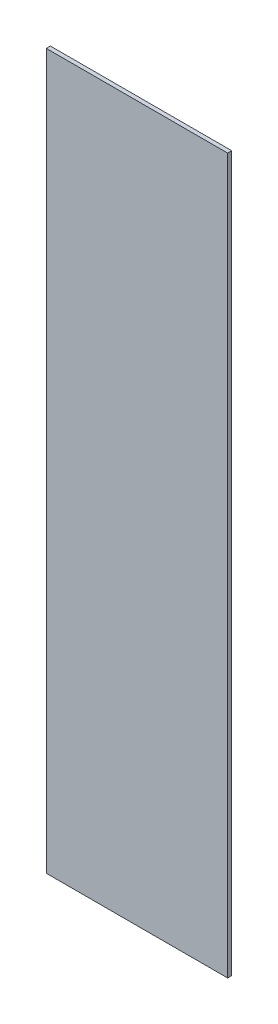
ISO-10303-21;
HEADER;
FILE_DESCRIPTION(('STEP AP214'),'2;1');
FILE_NAME('part.step','',(''),(''),'','','');
FILE_SCHEMA(('AUTOMOTIVE_DESIGN { 1 0 10303 214 1 1 1 1 }'));
ENDSEC;
DATA;
#1=APPLICATION_CONTEXT('core data for automotive mechanical design processes');
#2=APPLICATION_PROTOCOL_DEFINITION('international standard','automotive_design',2000,#1);
#3=PRODUCT_CONTEXT('',#1,'mechanical');
#4=PRODUCT('Part','Part','',(#3));
#5=PRODUCT_RELATED_PRODUCT_CATEGORY('part','',(#4));
#6=PRODUCT_DEFINITION_FORMATION('','',#4);
#7=PRODUCT_DEFINITION_CONTEXT('part definition',#1,'design');
#8=PRODUCT_DEFINITION('design','',#6,#7);
#9=PRODUCT_DEFINITION_SHAPE('','',#8);
#10=(LENGTH_UNIT() NAMED_UNIT(*) SI_UNIT(.MILLI.,.METRE.));
#11=(NAMED_UNIT(*) PLANE_ANGLE_UNIT() SI_UNIT($,.RADIAN.));
#12=(NAMED_UNIT(*) SI_UNIT($,.STERADIAN.) SOLID_ANGLE_UNIT());
#13=UNCERTAINTY_MEASURE_WITH_UNIT(LENGTH_MEASURE(1.E-05),#10,'distance_accuracy_value','');
#14=(GEOMETRIC_REPRESENTATION_CONTEXT(3) GLOBAL_UNCERTAINTY_ASSIGNED_CONTEXT((#13)) GLOBAL_UNIT_ASSIGNED_CONTEXT((#10,
#11,#12)) REPRESENTATION_CONTEXT('',''));
#15=CARTESIAN_POINT('',(0.,0.,0.));
#16=DIRECTION('',(0.,0.,1.));
#17=DIRECTION('',(1.,0.,0.));
#18=AXIS2_PLACEMENT_3D('',#15,#16,#17);
#19=CARTESIAN_POINT('',(-0.0854193448406502,0.92595557828035,0.00015));
#20=DIRECTION('',(0.,1.,0.));
#21=DIRECTION('',(0.,0.,1.));
#22=AXIS2_PLACEMENT_3D('',#19,#20,#21);
#23=PLANE('',#22);
#24=DIRECTION('',(0.,0.,1.));
#25=VECTOR('',#24,1.);
#26=CARTESIAN_POINT('',(-0.0887533139156502,0.92595557828035,0.));
#27=LINE('',#26,#25);
#28=CARTESIAN_POINT('',(-0.0887533139156502,0.92595557828035,0.));
#29=VERTEX_POINT('',#28);
#30=CARTESIAN_POINT('',(-0.0887533139156502,0.92595557828035,0.00015));
#31=VERTEX_POINT('',#30);
#32=EDGE_CURVE('E11',#29,#31,#27,.T.);
#33=ORIENTED_EDGE('',*,*,#32,.T.);
#34=DIRECTION('',(1.,0.,0.));
#35=VECTOR('',#34,1.);
#36=CARTESIAN_POINT('',(-0.0887533139156502,0.92595557828035,0.00015));
#37=LINE('',#36,#35);
#38=CARTESIAN_POINT('',(-0.0820853757656502,0.92595557828035,0.00015));
#39=VERTEX_POINT('',#38);
#40=EDGE_CURVE('E24',#31,#39,#37,.T.);
#41=ORIENTED_EDGE('',*,*,#40,.T.);
#42=DIRECTION('',(0.,0.,1.));
#43=VECTOR('',#42,1.);
#44=CARTESIAN_POINT('',(-0.0820853757656502,0.92595557828035,0.));
#45=LINE('',#44,#43);
#46=CARTESIAN_POINT('',(-0.0820853757656502,0.92595557828035,0.));
#47=VERTEX_POINT('',#46);
#48=EDGE_CURVE('E85',#47,#39,#45,.T.);
#49=ORIENTED_EDGE('',*,*,#48,.F.);
#50=DIRECTION('',(1.,0.,0.));
#51=VECTOR('',#50,1.);
#52=CARTESIAN_POINT('',(-0.0887533139156502,0.92595557828035,0.));
#53=LINE('',#52,#51);
#54=EDGE_CURVE('E83',#29,#47,#53,.T.);
#55=ORIENTED_EDGE('',*,*,#54,.F.);
#56=EDGE_LOOP('',(#33,#41,#49,#55));
#57=FACE_BOUND('',#56,.T.);
#58=ADVANCED_FACE('F17',(#57),#23,.T.);
#59=CARTESIAN_POINT('',(-0.0820853757656502,0.9128238842195,0.00015));
#60=DIRECTION('',(1.,0.,0.));
#61=DIRECTION('',(0.,0.,-1.));
#62=AXIS2_PLACEMENT_3D('',#59,#60,#61);
#63=PLANE('',#62);
#64=ORIENTED_EDGE('',*,*,#48,.T.);
#65=DIRECTION('',(0.,-1.,0.));
#66=VECTOR('',#65,1.);
#67=CARTESIAN_POINT('',(-0.0820853757656502,0.92595557828035,0.00015));
#68=LINE('',#67,#66);
#69=CARTESIAN_POINT('',(-0.0820853757656502,0.89969219015865,0.00015));
#70=VERTEX_POINT('',#69);
#71=EDGE_CURVE('E81',#39,#70,#68,.T.);
#72=ORIENTED_EDGE('',*,*,#71,.T.);
#73=DIRECTION('',(0.,0.,1.));
#74=VECTOR('',#73,1.);
#75=CARTESIAN_POINT('',(-0.0820853757656502,0.89969219015865,0.));
#76=LINE('',#75,#74);
#77=CARTESIAN_POINT('',(-0.0820853757656502,0.89969219015865,0.));
#78=VERTEX_POINT('',#77);
#79=EDGE_CURVE('E79',#78,#70,#76,.T.);
#80=ORIENTED_EDGE('',*,*,#79,.F.);
#81=DIRECTION('',(0.,-1.,0.));
#82=VECTOR('',#81,1.);
#83=CARTESIAN_POINT('',(-0.0820853757656502,0.92595557828035,0.));
#84=LINE('',#83,#82);
#85=EDGE_CURVE('E70',#47,#78,#84,.T.);
#86=ORIENTED_EDGE('',*,*,#85,.F.);
#87=EDGE_LOOP('',(#64,#72,#80,#86));
#88=FACE_BOUND('',#87,.T.);
#89=ADVANCED_FACE('F90',(#88),#63,.T.);
#90=CARTESIAN_POINT('',(-0.0854193448406502,0.89969219015865,0.00015));
#91=DIRECTION('',(0.,-1.,0.));
#92=DIRECTION('',(0.,0.,-1.));
#93=AXIS2_PLACEMENT_3D('',#90,#91,#92);
#94=PLANE('',#93);
#95=ORIENTED_EDGE('',*,*,#79,.T.);
#96=DIRECTION('',(-1.,0.,0.));
#97=VECTOR('',#96,1.);
#98=CARTESIAN_POINT('',(-0.0820853757656502,0.89969219015865,0.00015));
#99=LINE('',#98,#97);
#100=CARTESIAN_POINT('',(-0.0887533139156502,0.89969219015865,0.00015));
#101=VERTEX_POINT('',#100);
#102=EDGE_CURVE('E60',#70,#101,#99,.T.);
#103=ORIENTED_EDGE('',*,*,#102,.T.);
#104=DIRECTION('',(0.,0.,1.));
#105=VECTOR('',#104,1.);
#106=CARTESIAN_POINT('',(-0.0887533139156502,0.89969219015865,0.));
#107=LINE('',#106,#105);
#108=CARTESIAN_POINT('',(-0.0887533139156502,0.89969219015865,0.));
#109=VERTEX_POINT('',#108);
#110=EDGE_CURVE('E54',#109,#101,#107,.T.);
#111=ORIENTED_EDGE('',*,*,#110,.F.);
#112=DIRECTION('',(-1.,0.,0.));
#113=VECTOR('',#112,1.);
#114=CARTESIAN_POINT('',(-0.0820853757656502,0.89969219015865,0.));
#115=LINE('',#114,#113);
#116=EDGE_CURVE('E58',#78,#109,#115,.T.);
#117=ORIENTED_EDGE('',*,*,#116,.F.);
#118=EDGE_LOOP('',(#95,#103,#111,#117));
#119=FACE_BOUND('',#118,.T.);
#120=ADVANCED_FACE('F57',(#119),#94,.T.);
#121=CARTESIAN_POINT('',(-0.0887533139156502,0.9128238842195,0.00015));
#122=DIRECTION('',(-1.,0.,0.));
#123=DIRECTION('',(0.,0.,1.));
#124=AXIS2_PLACEMENT_3D('',#121,#122,#123);
#125=PLANE('',#124);
#126=ORIENTED_EDGE('',*,*,#110,.T.);
#127=DIRECTION('',(0.,1.,0.));
#128=VECTOR('',#127,1.);
#129=CARTESIAN_POINT('',(-0.0887533139156502,0.89969219015865,0.00015));
#130=LINE('',#129,#128);
#131=EDGE_CURVE('E71',#101,#31,#130,.T.);
#132=ORIENTED_EDGE('',*,*,#131,.T.);
#133=ORIENTED_EDGE('',*,*,#32,.F.);
#134=DIRECTION('',(0.,1.,0.));
#135=VECTOR('',#134,1.);
#136=CARTESIAN_POINT('',(-0.0887533139156502,0.89969219015865,0.));
#137=LINE('',#136,#135);
#138=EDGE_CURVE('E68',#109,#29,#137,.T.);
#139=ORIENTED_EDGE('',*,*,#138,.F.);
#140=EDGE_LOOP('',(#126,#132,#133,#139));
#141=FACE_BOUND('',#140,.T.);
#142=ADVANCED_FACE('F73',(#141),#125,.T.);
#143=CARTESIAN_POINT('',(-0.0854193448406502,0.89969219015865,0.));
#144=DIRECTION('',(0.,0.,1.));
#145=DIRECTION('',(1.,0.,0.));
#146=AXIS2_PLACEMENT_3D('',#143,#144,#145);
#147=PLANE('',#146);
#148=ORIENTED_EDGE('',*,*,#54,.T.);
#149=ORIENTED_EDGE('',*,*,#85,.T.);
#150=ORIENTED_EDGE('',*,*,#116,.T.);
#151=ORIENTED_EDGE('',*,*,#138,.T.);
#152=EDGE_LOOP('',(#148,#149,#150,#151));
#153=FACE_BOUND('',#152,.T.);
#154=ADVANCED_FACE('F67',(#153),#147,.F.);
#155=CARTESIAN_POINT('',(-0.0854193448406502,0.89969219015865,0.00015));
#156=DIRECTION('',(0.,0.,1.));
#157=DIRECTION('',(1.,0.,0.));
#158=AXIS2_PLACEMENT_3D('',#155,#156,#157);
#159=PLANE('',#158);
#160=ORIENTED_EDGE('',*,*,#40,.F.);
#161=ORIENTED_EDGE('',*,*,#131,.F.);
#162=ORIENTED_EDGE('',*,*,#102,.F.);
#163=ORIENTED_EDGE('',*,*,#71,.F.);
#164=EDGE_LOOP('',(#160,#161,#162,#163));
#165=FACE_BOUND('',#164,.T.);
#166=ADVANCED_FACE('F91',(#165),#159,.T.);
#167=CLOSED_SHELL('',(#58,#89,#120,#142,#154,#166));
#168=MANIFOLD_SOLID_BREP('B1',#167);
#169=ADVANCED_BREP_SHAPE_REPRESENTATION('',(#18,#168),#14);
#170=SHAPE_DEFINITION_REPRESENTATION(#9,#169);
ENDSEC;
END-ISO-10303-21;
